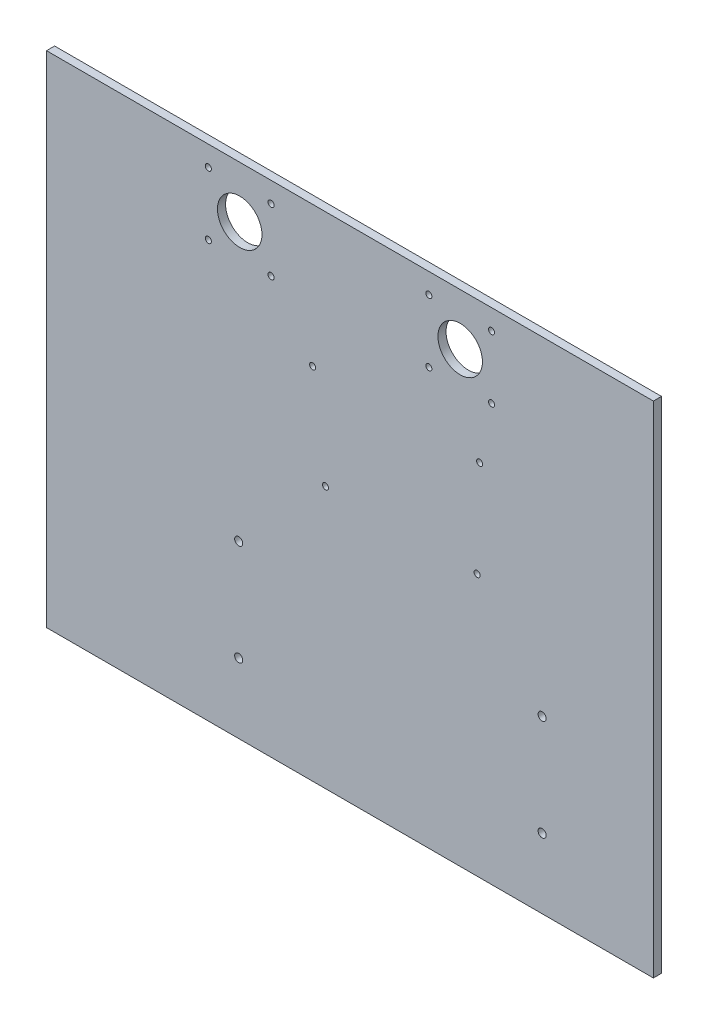
ISO-10303-21;
HEADER;
FILE_DESCRIPTION(('STEP AP214'),'2;1');
FILE_NAME('part.step','',(''),(''),'','','');
FILE_SCHEMA(('AUTOMOTIVE_DESIGN { 1 0 10303 214 1 1 1 1 }'));
ENDSEC;
DATA;
#1=APPLICATION_CONTEXT('core data for automotive mechanical design processes');
#2=APPLICATION_PROTOCOL_DEFINITION('international standard','automotive_design',2000,#1);
#3=PRODUCT_CONTEXT('',#1,'mechanical');
#4=PRODUCT('Part','Part','',(#3));
#5=PRODUCT_RELATED_PRODUCT_CATEGORY('part','',(#4));
#6=PRODUCT_DEFINITION_FORMATION('','',#4);
#7=PRODUCT_DEFINITION_CONTEXT('part definition',#1,'design');
#8=PRODUCT_DEFINITION('design','',#6,#7);
#9=PRODUCT_DEFINITION_SHAPE('','',#8);
#10=(LENGTH_UNIT() NAMED_UNIT(*) SI_UNIT(.MILLI.,.METRE.));
#11=(NAMED_UNIT(*) PLANE_ANGLE_UNIT() SI_UNIT($,.RADIAN.));
#12=(NAMED_UNIT(*) SI_UNIT($,.STERADIAN.) SOLID_ANGLE_UNIT());
#13=UNCERTAINTY_MEASURE_WITH_UNIT(LENGTH_MEASURE(1.E-05),#10,'distance_accuracy_value','');
#14=(GEOMETRIC_REPRESENTATION_CONTEXT(3) GLOBAL_UNCERTAINTY_ASSIGNED_CONTEXT((#13)) GLOBAL_UNIT_ASSIGNED_CONTEXT((#10,
#11,#12)) REPRESENTATION_CONTEXT('',''));
#15=CARTESIAN_POINT('',(0.,0.,0.));
#16=DIRECTION('',(0.,0.,1.));
#17=DIRECTION('',(1.,0.,0.));
#18=AXIS2_PLACEMENT_3D('',#15,#16,#17);
#19=CARTESIAN_POINT('',(0.,0.,4.));
#20=DIRECTION('',(0.,0.,1.));
#21=DIRECTION('',(1.,0.,0.));
#22=AXIS2_PLACEMENT_3D('',#19,#20,#21);
#23=PLANE('',#22);
#24=CARTESIAN_POINT('',(62.8513187967979,5.93512971337509,4.));
#25=DIRECTION('',(0.,0.,1.));
#26=DIRECTION('',(1.,0.,0.));
#27=AXIS2_PLACEMENT_3D('',#24,#25,#26);
#28=CIRCLE('',#27,1.5);
#29=CARTESIAN_POINT('',(64.3513187967979,5.93512971337509,4.));
#30=VERTEX_POINT('',#29);
#31=EDGE_CURVE('E205',#30,#30,#28,.T.);
#32=ORIENTED_EDGE('',*,*,#31,.F.);
#33=EDGE_LOOP('',(#32));
#34=FACE_BOUND('',#33,.T.);
#35=CARTESIAN_POINT('',(64.1213187967974,54.1951297133751,4.));
#36=DIRECTION('',(0.,0.,1.));
#37=DIRECTION('',(1.,0.,0.));
#38=AXIS2_PLACEMENT_3D('',#35,#36,#37);
#39=CIRCLE('',#38,1.5);
#40=CARTESIAN_POINT('',(65.6213187967974,54.1951297133751,4.));
#41=VERTEX_POINT('',#40);
#42=EDGE_CURVE('E193',#41,#41,#39,.T.);
#43=ORIENTED_EDGE('',*,*,#42,.F.);
#44=EDGE_LOOP('',(#43));
#45=FACE_BOUND('',#44,.T.);
#46=CARTESIAN_POINT('',(-55.0000000000043,-39.0000000000006,4.));
#47=DIRECTION('',(0.,0.,1.));
#48=DIRECTION('',(1.,0.,0.));
#49=AXIS2_PLACEMENT_3D('',#46,#47,#48);
#50=CIRCLE('',#49,2.);
#51=CARTESIAN_POINT('',(-53.0000000000042,-39.0000000000006,4.));
#52=VERTEX_POINT('',#51);
#53=EDGE_CURVE('E181',#52,#52,#50,.T.);
#54=ORIENTED_EDGE('',*,*,#53,.F.);
#55=EDGE_LOOP('',(#54));
#56=FACE_BOUND('',#55,.T.);
#57=CARTESIAN_POINT('',(94.9999999999957,-39.0000000000007,4.));
#58=DIRECTION('',(0.,0.,1.));
#59=DIRECTION('',(1.,0.,0.));
#60=AXIS2_PLACEMENT_3D('',#57,#58,#59);
#61=CIRCLE('',#60,2.);
#62=CARTESIAN_POINT('',(96.9999999999957,-39.0000000000007,4.));
#63=VERTEX_POINT('',#62);
#64=EDGE_CURVE('E169',#63,#63,#61,.T.);
#65=ORIENTED_EDGE('',*,*,#64,.F.);
#66=EDGE_LOOP('',(#65));
#67=FACE_BOUND('',#66,.T.);
#68=CARTESIAN_POINT('',(39.,113.5,4.));
#69=DIRECTION('',(0.,0.,1.));
#70=DIRECTION('',(-1.,0.,0.));
#71=AXIS2_PLACEMENT_3D('',#68,#69,#70);
#72=CIRCLE('',#71,1.5);
#73=CARTESIAN_POINT('',(37.5,113.5,4.));
#74=VERTEX_POINT('',#73);
#75=EDGE_CURVE('E157',#74,#74,#72,.T.);
#76=ORIENTED_EDGE('',*,*,#75,.F.);
#77=EDGE_LOOP('',(#76));
#78=FACE_BOUND('',#77,.T.);
#79=CARTESIAN_POINT('',(39.,82.5,4.));
#80=DIRECTION('',(0.,0.,1.));
#81=DIRECTION('',(-1.,0.,0.));
#82=AXIS2_PLACEMENT_3D('',#79,#80,#81);
#83=CIRCLE('',#82,1.5);
#84=CARTESIAN_POINT('',(37.5,82.5,4.));
#85=VERTEX_POINT('',#84);
#86=EDGE_CURVE('E145',#85,#85,#83,.T.);
#87=ORIENTED_EDGE('',*,*,#86,.F.);
#88=EDGE_LOOP('',(#87));
#89=FACE_BOUND('',#88,.T.);
#90=CARTESIAN_POINT('',(-54.5,98.,4.));
#91=DIRECTION('',(0.,0.,1.));
#92=DIRECTION('',(1.,0.,0.));
#93=AXIS2_PLACEMENT_3D('',#90,#91,#92);
#94=CIRCLE('',#93,11.);
#95=CARTESIAN_POINT('',(-43.5,98.,4.));
#96=VERTEX_POINT('',#95);
#97=EDGE_CURVE('E133',#96,#96,#94,.T.);
#98=ORIENTED_EDGE('',*,*,#97,.F.);
#99=EDGE_LOOP('',(#98));
#100=FACE_BOUND('',#99,.T.);
#101=CARTESIAN_POINT('',(-39.,82.5,4.));
#102=DIRECTION('',(0.,0.,1.));
#103=DIRECTION('',(1.,0.,0.));
#104=AXIS2_PLACEMENT_3D('',#101,#102,#103);
#105=CIRCLE('',#104,1.5);
#106=CARTESIAN_POINT('',(-37.5,82.5,4.));
#107=VERTEX_POINT('',#106);
#108=EDGE_CURVE('E121',#107,#107,#105,.T.);
#109=ORIENTED_EDGE('',*,*,#108,.F.);
#110=EDGE_LOOP('',(#109));
#111=FACE_BOUND('',#110,.T.);
#112=CARTESIAN_POINT('',(-70.,113.5,4.));
#113=DIRECTION('',(0.,0.,1.));
#114=DIRECTION('',(1.,0.,0.));
#115=AXIS2_PLACEMENT_3D('',#112,#113,#114);
#116=CIRCLE('',#115,1.5);
#117=CARTESIAN_POINT('',(-68.5,113.5,4.));
#118=VERTEX_POINT('',#117);
#119=EDGE_CURVE('E100',#118,#118,#116,.T.);
#120=ORIENTED_EDGE('',*,*,#119,.F.);
#121=EDGE_LOOP('',(#120));
#122=FACE_BOUND('',#121,.T.);
#123=DIRECTION('',(0.,-1.,0.));
#124=VECTOR('',#123,1.);
#125=CARTESIAN_POINT('',(-150.,-123.5,4.));
#126=LINE('',#125,#124);
#127=CARTESIAN_POINT('',(-150.,123.5,4.));
#128=VERTEX_POINT('',#127);
#129=CARTESIAN_POINT('',(-150.,-123.5,4.));
#130=VERTEX_POINT('',#129);
#131=EDGE_CURVE('E85',#128,#130,#126,.T.);
#132=ORIENTED_EDGE('',*,*,#131,.T.);
#133=DIRECTION('',(1.,0.,0.));
#134=VECTOR('',#133,1.);
#135=CARTESIAN_POINT('',(150.,-123.5,4.));
#136=LINE('',#135,#134);
#137=CARTESIAN_POINT('',(150.,-123.5,4.));
#138=VERTEX_POINT('',#137);
#139=EDGE_CURVE('E80',#130,#138,#136,.T.);
#140=ORIENTED_EDGE('',*,*,#139,.T.);
#141=DIRECTION('',(0.,1.,0.));
#142=VECTOR('',#141,1.);
#143=CARTESIAN_POINT('',(150.,-123.5,4.));
#144=LINE('',#143,#142);
#145=CARTESIAN_POINT('',(150.,123.5,4.));
#146=VERTEX_POINT('',#145);
#147=EDGE_CURVE('E83',#138,#146,#144,.T.);
#148=ORIENTED_EDGE('',*,*,#147,.T.);
#149=DIRECTION('',(-1.,0.,0.));
#150=VECTOR('',#149,1.);
#151=CARTESIAN_POINT('',(150.,123.5,4.));
#152=LINE('',#151,#150);
#153=EDGE_CURVE('E50',#146,#128,#152,.T.);
#154=ORIENTED_EDGE('',*,*,#153,.T.);
#155=EDGE_LOOP('',(#132,#140,#148,#154));
#156=FACE_BOUND('',#155,.T.);
#157=CARTESIAN_POINT('',(-39.,113.5,4.));
#158=DIRECTION('',(0.,0.,1.));
#159=DIRECTION('',(1.,0.,0.));
#160=AXIS2_PLACEMENT_3D('',#157,#158,#159);
#161=CIRCLE('',#160,1.5);
#162=CARTESIAN_POINT('',(-37.5,113.5,4.));
#163=VERTEX_POINT('',#162);
#164=EDGE_CURVE('E115',#163,#163,#161,.T.);
#165=ORIENTED_EDGE('',*,*,#164,.F.);
#166=EDGE_LOOP('',(#165));
#167=FACE_BOUND('',#166,.T.);
#168=CARTESIAN_POINT('',(-70.,82.5,4.));
#169=DIRECTION('',(0.,0.,1.));
#170=DIRECTION('',(1.,0.,0.));
#171=AXIS2_PLACEMENT_3D('',#168,#169,#170);
#172=CIRCLE('',#171,1.5);
#173=CARTESIAN_POINT('',(-68.5,82.5,4.));
#174=VERTEX_POINT('',#173);
#175=EDGE_CURVE('E127',#174,#174,#172,.T.);
#176=ORIENTED_EDGE('',*,*,#175,.F.);
#177=EDGE_LOOP('',(#176));
#178=FACE_BOUND('',#177,.T.);
#179=CARTESIAN_POINT('',(70.,82.5,4.));
#180=DIRECTION('',(0.,0.,1.));
#181=DIRECTION('',(-1.,0.,0.));
#182=AXIS2_PLACEMENT_3D('',#179,#180,#181);
#183=CIRCLE('',#182,1.5);
#184=CARTESIAN_POINT('',(68.5,82.5,4.));
#185=VERTEX_POINT('',#184);
#186=EDGE_CURVE('E139',#185,#185,#183,.T.);
#187=ORIENTED_EDGE('',*,*,#186,.F.);
#188=EDGE_LOOP('',(#187));
#189=FACE_BOUND('',#188,.T.);
#190=CARTESIAN_POINT('',(54.5,98.,4.));
#191=DIRECTION('',(0.,0.,1.));
#192=DIRECTION('',(-1.,0.,0.));
#193=AXIS2_PLACEMENT_3D('',#190,#191,#192);
#194=CIRCLE('',#193,11.);
#195=CARTESIAN_POINT('',(43.5,98.,4.));
#196=VERTEX_POINT('',#195);
#197=EDGE_CURVE('E151',#196,#196,#194,.T.);
#198=ORIENTED_EDGE('',*,*,#197,.F.);
#199=EDGE_LOOP('',(#198));
#200=FACE_BOUND('',#199,.T.);
#201=CARTESIAN_POINT('',(70.,113.5,4.));
#202=DIRECTION('',(0.,0.,1.));
#203=DIRECTION('',(-1.,0.,0.));
#204=AXIS2_PLACEMENT_3D('',#201,#202,#203);
#205=CIRCLE('',#204,1.5);
#206=CARTESIAN_POINT('',(68.5,113.5,4.));
#207=VERTEX_POINT('',#206);
#208=EDGE_CURVE('E163',#207,#207,#205,.T.);
#209=ORIENTED_EDGE('',*,*,#208,.F.);
#210=EDGE_LOOP('',(#209));
#211=FACE_BOUND('',#210,.T.);
#212=CARTESIAN_POINT('',(94.9999999999957,-89.0000000000011,4.));
#213=DIRECTION('',(0.,0.,1.));
#214=DIRECTION('',(1.,0.,0.));
#215=AXIS2_PLACEMENT_3D('',#212,#213,#214);
#216=CIRCLE('',#215,2.);
#217=CARTESIAN_POINT('',(96.9999999999957,-89.0000000000011,4.));
#218=VERTEX_POINT('',#217);
#219=EDGE_CURVE('E175',#218,#218,#216,.T.);
#220=ORIENTED_EDGE('',*,*,#219,.F.);
#221=EDGE_LOOP('',(#220));
#222=FACE_BOUND('',#221,.T.);
#223=CARTESIAN_POINT('',(-55.0000000000042,-89.0000000000011,4.));
#224=DIRECTION('',(0.,0.,1.));
#225=DIRECTION('',(1.,0.,0.));
#226=AXIS2_PLACEMENT_3D('',#223,#224,#225);
#227=CIRCLE('',#226,2.);
#228=CARTESIAN_POINT('',(-53.0000000000042,-89.0000000000011,4.));
#229=VERTEX_POINT('',#228);
#230=EDGE_CURVE('E187',#229,#229,#227,.T.);
#231=ORIENTED_EDGE('',*,*,#230,.F.);
#232=EDGE_LOOP('',(#231));
#233=FACE_BOUND('',#232,.T.);
#234=CARTESIAN_POINT('',(-12.0786812032021,5.93512971337443,4.));
#235=DIRECTION('',(0.,0.,1.));
#236=DIRECTION('',(1.,0.,0.));
#237=AXIS2_PLACEMENT_3D('',#234,#235,#236);
#238=CIRCLE('',#237,1.5);
#239=CARTESIAN_POINT('',(-10.5786812032021,5.93512971337443,4.));
#240=VERTEX_POINT('',#239);
#241=EDGE_CURVE('E199',#240,#240,#238,.T.);
#242=ORIENTED_EDGE('',*,*,#241,.F.);
#243=EDGE_LOOP('',(#242));
#244=FACE_BOUND('',#243,.T.);
#245=CARTESIAN_POINT('',(-18.4286812032026,54.1951297133744,4.));
#246=DIRECTION('',(0.,0.,1.));
#247=DIRECTION('',(1.,0.,0.));
#248=AXIS2_PLACEMENT_3D('',#245,#246,#247);
#249=CIRCLE('',#248,1.5);
#250=CARTESIAN_POINT('',(-16.9286812032026,54.1951297133744,4.));
#251=VERTEX_POINT('',#250);
#252=EDGE_CURVE('E211',#251,#251,#249,.T.);
#253=ORIENTED_EDGE('',*,*,#252,.F.);
#254=EDGE_LOOP('',(#253));
#255=FACE_BOUND('',#254,.T.);
#256=ADVANCED_FACE('F33',(#34,#45,#56,#67,#78,#89,#100,#111,#122,#156,#167,#178,#189,#200,#211,
#222,#233,#244,#255),#23,.T.);
#257=CARTESIAN_POINT('',(0.,0.,0.));
#258=DIRECTION('',(0.,0.,1.));
#259=DIRECTION('',(1.,0.,0.));
#260=AXIS2_PLACEMENT_3D('',#257,#258,#259);
#261=PLANE('',#260);
#262=DIRECTION('',(0.,-1.,0.));
#263=VECTOR('',#262,1.);
#264=CARTESIAN_POINT('',(-150.,-123.5,0.));
#265=LINE('',#264,#263);
#266=CARTESIAN_POINT('',(-150.,123.5,0.));
#267=VERTEX_POINT('',#266);
#268=CARTESIAN_POINT('',(-150.,-123.5,0.));
#269=VERTEX_POINT('',#268);
#270=EDGE_CURVE('E97',#267,#269,#265,.T.);
#271=ORIENTED_EDGE('',*,*,#270,.F.);
#272=DIRECTION('',(-1.,0.,0.));
#273=VECTOR('',#272,1.);
#274=CARTESIAN_POINT('',(150.,123.5,0.));
#275=LINE('',#274,#273);
#276=CARTESIAN_POINT('',(150.,123.5,0.));
#277=VERTEX_POINT('',#276);
#278=EDGE_CURVE('E73',#277,#267,#275,.T.);
#279=ORIENTED_EDGE('',*,*,#278,.F.);
#280=DIRECTION('',(0.,1.,0.));
#281=VECTOR('',#280,1.);
#282=CARTESIAN_POINT('',(150.,-123.5,0.));
#283=LINE('',#282,#281);
#284=CARTESIAN_POINT('',(150.,-123.5,0.));
#285=VERTEX_POINT('',#284);
#286=EDGE_CURVE('E67',#285,#277,#283,.T.);
#287=ORIENTED_EDGE('',*,*,#286,.F.);
#288=DIRECTION('',(1.,0.,0.));
#289=VECTOR('',#288,1.);
#290=CARTESIAN_POINT('',(150.,-123.5,0.));
#291=LINE('',#290,#289);
#292=EDGE_CURVE('E89',#269,#285,#291,.T.);
#293=ORIENTED_EDGE('',*,*,#292,.F.);
#294=EDGE_LOOP('',(#271,#279,#287,#293));
#295=FACE_BOUND('',#294,.T.);
#296=CARTESIAN_POINT('',(-70.,113.5,0.));
#297=DIRECTION('',(0.,0.,1.));
#298=DIRECTION('',(1.,0.,0.));
#299=AXIS2_PLACEMENT_3D('',#296,#297,#298);
#300=CIRCLE('',#299,1.5);
#301=CARTESIAN_POINT('',(-68.5,113.5,0.));
#302=VERTEX_POINT('',#301);
#303=EDGE_CURVE('E112',#302,#302,#300,.T.);
#304=ORIENTED_EDGE('',*,*,#303,.T.);
#305=EDGE_LOOP('',(#304));
#306=FACE_BOUND('',#305,.T.);
#307=CARTESIAN_POINT('',(-39.,113.5,0.));
#308=DIRECTION('',(0.,0.,1.));
#309=DIRECTION('',(1.,0.,0.));
#310=AXIS2_PLACEMENT_3D('',#307,#308,#309);
#311=CIRCLE('',#310,1.5);
#312=CARTESIAN_POINT('',(-37.5,113.5,0.));
#313=VERTEX_POINT('',#312);
#314=EDGE_CURVE('E118',#313,#313,#311,.T.);
#315=ORIENTED_EDGE('',*,*,#314,.T.);
#316=EDGE_LOOP('',(#315));
#317=FACE_BOUND('',#316,.T.);
#318=CARTESIAN_POINT('',(-39.,82.5,0.));
#319=DIRECTION('',(0.,0.,1.));
#320=DIRECTION('',(1.,0.,0.));
#321=AXIS2_PLACEMENT_3D('',#318,#319,#320);
#322=CIRCLE('',#321,1.5);
#323=CARTESIAN_POINT('',(-37.5,82.5,0.));
#324=VERTEX_POINT('',#323);
#325=EDGE_CURVE('E124',#324,#324,#322,.T.);
#326=ORIENTED_EDGE('',*,*,#325,.T.);
#327=EDGE_LOOP('',(#326));
#328=FACE_BOUND('',#327,.T.);
#329=CARTESIAN_POINT('',(-70.,82.5,0.));
#330=DIRECTION('',(0.,0.,1.));
#331=DIRECTION('',(1.,0.,0.));
#332=AXIS2_PLACEMENT_3D('',#329,#330,#331);
#333=CIRCLE('',#332,1.5);
#334=CARTESIAN_POINT('',(-68.5,82.5,0.));
#335=VERTEX_POINT('',#334);
#336=EDGE_CURVE('E130',#335,#335,#333,.T.);
#337=ORIENTED_EDGE('',*,*,#336,.T.);
#338=EDGE_LOOP('',(#337));
#339=FACE_BOUND('',#338,.T.);
#340=CARTESIAN_POINT('',(-54.5,98.,0.));
#341=DIRECTION('',(0.,0.,1.));
#342=DIRECTION('',(1.,0.,0.));
#343=AXIS2_PLACEMENT_3D('',#340,#341,#342);
#344=CIRCLE('',#343,11.);
#345=CARTESIAN_POINT('',(-43.5,98.,0.));
#346=VERTEX_POINT('',#345);
#347=EDGE_CURVE('E136',#346,#346,#344,.T.);
#348=ORIENTED_EDGE('',*,*,#347,.T.);
#349=EDGE_LOOP('',(#348));
#350=FACE_BOUND('',#349,.T.);
#351=CARTESIAN_POINT('',(70.,82.5,0.));
#352=DIRECTION('',(0.,0.,1.));
#353=DIRECTION('',(-1.,0.,0.));
#354=AXIS2_PLACEMENT_3D('',#351,#352,#353);
#355=CIRCLE('',#354,1.5);
#356=CARTESIAN_POINT('',(68.5,82.5,0.));
#357=VERTEX_POINT('',#356);
#358=EDGE_CURVE('E142',#357,#357,#355,.T.);
#359=ORIENTED_EDGE('',*,*,#358,.T.);
#360=EDGE_LOOP('',(#359));
#361=FACE_BOUND('',#360,.T.);
#362=CARTESIAN_POINT('',(39.,82.5,0.));
#363=DIRECTION('',(0.,0.,1.));
#364=DIRECTION('',(-1.,0.,0.));
#365=AXIS2_PLACEMENT_3D('',#362,#363,#364);
#366=CIRCLE('',#365,1.5);
#367=CARTESIAN_POINT('',(37.5,82.5,0.));
#368=VERTEX_POINT('',#367);
#369=EDGE_CURVE('E148',#368,#368,#366,.T.);
#370=ORIENTED_EDGE('',*,*,#369,.T.);
#371=EDGE_LOOP('',(#370));
#372=FACE_BOUND('',#371,.T.);
#373=CARTESIAN_POINT('',(54.5,98.,0.));
#374=DIRECTION('',(0.,0.,1.));
#375=DIRECTION('',(-1.,0.,0.));
#376=AXIS2_PLACEMENT_3D('',#373,#374,#375);
#377=CIRCLE('',#376,11.);
#378=CARTESIAN_POINT('',(43.5,98.,0.));
#379=VERTEX_POINT('',#378);
#380=EDGE_CURVE('E154',#379,#379,#377,.T.);
#381=ORIENTED_EDGE('',*,*,#380,.T.);
#382=EDGE_LOOP('',(#381));
#383=FACE_BOUND('',#382,.T.);
#384=CARTESIAN_POINT('',(39.,113.5,0.));
#385=DIRECTION('',(0.,0.,1.));
#386=DIRECTION('',(-1.,0.,0.));
#387=AXIS2_PLACEMENT_3D('',#384,#385,#386);
#388=CIRCLE('',#387,1.5);
#389=CARTESIAN_POINT('',(37.5,113.5,0.));
#390=VERTEX_POINT('',#389);
#391=EDGE_CURVE('E160',#390,#390,#388,.T.);
#392=ORIENTED_EDGE('',*,*,#391,.T.);
#393=EDGE_LOOP('',(#392));
#394=FACE_BOUND('',#393,.T.);
#395=CARTESIAN_POINT('',(70.,113.5,0.));
#396=DIRECTION('',(0.,0.,1.));
#397=DIRECTION('',(-1.,0.,0.));
#398=AXIS2_PLACEMENT_3D('',#395,#396,#397);
#399=CIRCLE('',#398,1.5);
#400=CARTESIAN_POINT('',(68.5,113.5,0.));
#401=VERTEX_POINT('',#400);
#402=EDGE_CURVE('E166',#401,#401,#399,.T.);
#403=ORIENTED_EDGE('',*,*,#402,.T.);
#404=EDGE_LOOP('',(#403));
#405=FACE_BOUND('',#404,.T.);
#406=CARTESIAN_POINT('',(94.9999999999957,-39.0000000000007,0.));
#407=DIRECTION('',(0.,0.,1.));
#408=DIRECTION('',(1.,0.,0.));
#409=AXIS2_PLACEMENT_3D('',#406,#407,#408);
#410=CIRCLE('',#409,2.);
#411=CARTESIAN_POINT('',(96.9999999999957,-39.0000000000007,0.));
#412=VERTEX_POINT('',#411);
#413=EDGE_CURVE('E172',#412,#412,#410,.T.);
#414=ORIENTED_EDGE('',*,*,#413,.T.);
#415=EDGE_LOOP('',(#414));
#416=FACE_BOUND('',#415,.T.);
#417=CARTESIAN_POINT('',(94.9999999999957,-89.0000000000011,0.));
#418=DIRECTION('',(0.,0.,1.));
#419=DIRECTION('',(1.,0.,0.));
#420=AXIS2_PLACEMENT_3D('',#417,#418,#419);
#421=CIRCLE('',#420,2.);
#422=CARTESIAN_POINT('',(96.9999999999957,-89.0000000000011,0.));
#423=VERTEX_POINT('',#422);
#424=EDGE_CURVE('E178',#423,#423,#421,.T.);
#425=ORIENTED_EDGE('',*,*,#424,.T.);
#426=EDGE_LOOP('',(#425));
#427=FACE_BOUND('',#426,.T.);
#428=CARTESIAN_POINT('',(-55.0000000000043,-39.0000000000006,0.));
#429=DIRECTION('',(0.,0.,1.));
#430=DIRECTION('',(1.,0.,0.));
#431=AXIS2_PLACEMENT_3D('',#428,#429,#430);
#432=CIRCLE('',#431,2.);
#433=CARTESIAN_POINT('',(-53.0000000000042,-39.0000000000006,0.));
#434=VERTEX_POINT('',#433);
#435=EDGE_CURVE('E184',#434,#434,#432,.T.);
#436=ORIENTED_EDGE('',*,*,#435,.T.);
#437=EDGE_LOOP('',(#436));
#438=FACE_BOUND('',#437,.T.);
#439=CARTESIAN_POINT('',(-55.0000000000042,-89.0000000000011,0.));
#440=DIRECTION('',(0.,0.,1.));
#441=DIRECTION('',(1.,0.,0.));
#442=AXIS2_PLACEMENT_3D('',#439,#440,#441);
#443=CIRCLE('',#442,2.);
#444=CARTESIAN_POINT('',(-53.0000000000042,-89.0000000000011,0.));
#445=VERTEX_POINT('',#444);
#446=EDGE_CURVE('E190',#445,#445,#443,.T.);
#447=ORIENTED_EDGE('',*,*,#446,.T.);
#448=EDGE_LOOP('',(#447));
#449=FACE_BOUND('',#448,.T.);
#450=CARTESIAN_POINT('',(64.1213187967974,54.1951297133751,0.));
#451=DIRECTION('',(0.,0.,1.));
#452=DIRECTION('',(1.,0.,0.));
#453=AXIS2_PLACEMENT_3D('',#450,#451,#452);
#454=CIRCLE('',#453,1.5);
#455=CARTESIAN_POINT('',(65.6213187967974,54.1951297133751,0.));
#456=VERTEX_POINT('',#455);
#457=EDGE_CURVE('E196',#456,#456,#454,.T.);
#458=ORIENTED_EDGE('',*,*,#457,.T.);
#459=EDGE_LOOP('',(#458));
#460=FACE_BOUND('',#459,.T.);
#461=CARTESIAN_POINT('',(-12.0786812032021,5.93512971337443,0.));
#462=DIRECTION('',(0.,0.,1.));
#463=DIRECTION('',(1.,0.,0.));
#464=AXIS2_PLACEMENT_3D('',#461,#462,#463);
#465=CIRCLE('',#464,1.5);
#466=CARTESIAN_POINT('',(-10.5786812032021,5.93512971337443,0.));
#467=VERTEX_POINT('',#466);
#468=EDGE_CURVE('E202',#467,#467,#465,.T.);
#469=ORIENTED_EDGE('',*,*,#468,.T.);
#470=EDGE_LOOP('',(#469));
#471=FACE_BOUND('',#470,.T.);
#472=CARTESIAN_POINT('',(62.8513187967979,5.93512971337509,0.));
#473=DIRECTION('',(0.,0.,1.));
#474=DIRECTION('',(1.,0.,0.));
#475=AXIS2_PLACEMENT_3D('',#472,#473,#474);
#476=CIRCLE('',#475,1.5);
#477=CARTESIAN_POINT('',(64.3513187967979,5.93512971337509,0.));
#478=VERTEX_POINT('',#477);
#479=EDGE_CURVE('E208',#478,#478,#476,.T.);
#480=ORIENTED_EDGE('',*,*,#479,.T.);
#481=EDGE_LOOP('',(#480));
#482=FACE_BOUND('',#481,.T.);
#483=CARTESIAN_POINT('',(-18.4286812032026,54.1951297133744,0.));
#484=DIRECTION('',(0.,0.,1.));
#485=DIRECTION('',(1.,0.,0.));
#486=AXIS2_PLACEMENT_3D('',#483,#484,#485);
#487=CIRCLE('',#486,1.5);
#488=CARTESIAN_POINT('',(-16.9286812032026,54.1951297133744,0.));
#489=VERTEX_POINT('',#488);
#490=EDGE_CURVE('E214',#489,#489,#487,.T.);
#491=ORIENTED_EDGE('',*,*,#490,.T.);
#492=EDGE_LOOP('',(#491));
#493=FACE_BOUND('',#492,.T.);
#494=ADVANCED_FACE('F108',(#295,#306,#317,#328,#339,#350,#361,#372,#383,#394,#405,#416,#427,
#438,#449,#460,#471,#482,#493),#261,.F.);
#495=CARTESIAN_POINT('',(-150.,-123.5,4.));
#496=DIRECTION('',(1.,0.,0.));
#497=DIRECTION('',(0.,1.,0.));
#498=AXIS2_PLACEMENT_3D('',#495,#496,#497);
#499=PLANE('',#498);
#500=ORIENTED_EDGE('',*,*,#270,.T.);
#501=DIRECTION('',(0.,0.,-1.));
#502=VECTOR('',#501,1.);
#503=CARTESIAN_POINT('',(-150.,-123.5,4.));
#504=LINE('',#503,#502);
#505=EDGE_CURVE('E11',#130,#269,#504,.T.);
#506=ORIENTED_EDGE('',*,*,#505,.F.);
#507=ORIENTED_EDGE('',*,*,#131,.F.);
#508=DIRECTION('',(0.,0.,-1.));
#509=VECTOR('',#508,1.);
#510=CARTESIAN_POINT('',(-150.,123.5,4.));
#511=LINE('',#510,#509);
#512=EDGE_CURVE('E93',#128,#267,#511,.T.);
#513=ORIENTED_EDGE('',*,*,#512,.T.);
#514=EDGE_LOOP('',(#500,#506,#507,#513));
#515=FACE_BOUND('',#514,.T.);
#516=ADVANCED_FACE('F35',(#515),#499,.F.);
#517=CARTESIAN_POINT('',(150.,-123.5,4.));
#518=DIRECTION('',(0.,1.,0.));
#519=DIRECTION('',(-1.,0.,0.));
#520=AXIS2_PLACEMENT_3D('',#517,#518,#519);
#521=PLANE('',#520);
#522=ORIENTED_EDGE('',*,*,#292,.T.);
#523=DIRECTION('',(0.,0.,-1.));
#524=VECTOR('',#523,1.);
#525=CARTESIAN_POINT('',(150.,-123.5,4.));
#526=LINE('',#525,#524);
#527=EDGE_CURVE('E42',#138,#285,#526,.T.);
#528=ORIENTED_EDGE('',*,*,#527,.F.);
#529=ORIENTED_EDGE('',*,*,#139,.F.);
#530=ORIENTED_EDGE('',*,*,#505,.T.);
#531=EDGE_LOOP('',(#522,#528,#529,#530));
#532=FACE_BOUND('',#531,.T.);
#533=ADVANCED_FACE('F88',(#532),#521,.F.);
#534=CARTESIAN_POINT('',(150.,-123.5,4.));
#535=DIRECTION('',(-1.,0.,0.));
#536=DIRECTION('',(0.,0.,1.));
#537=AXIS2_PLACEMENT_3D('',#534,#535,#536);
#538=PLANE('',#537);
#539=ORIENTED_EDGE('',*,*,#286,.T.);
#540=DIRECTION('',(0.,0.,-1.));
#541=VECTOR('',#540,1.);
#542=CARTESIAN_POINT('',(150.,123.5,4.));
#543=LINE('',#542,#541);
#544=EDGE_CURVE('E90',#146,#277,#543,.T.);
#545=ORIENTED_EDGE('',*,*,#544,.F.);
#546=ORIENTED_EDGE('',*,*,#147,.F.);
#547=ORIENTED_EDGE('',*,*,#527,.T.);
#548=EDGE_LOOP('',(#539,#545,#546,#547));
#549=FACE_BOUND('',#548,.T.);
#550=ADVANCED_FACE('F91',(#549),#538,.F.);
#551=CARTESIAN_POINT('',(150.,123.5,4.));
#552=DIRECTION('',(0.,-1.,0.));
#553=DIRECTION('',(1.,0.,0.));
#554=AXIS2_PLACEMENT_3D('',#551,#552,#553);
#555=PLANE('',#554);
#556=ORIENTED_EDGE('',*,*,#278,.T.);
#557=ORIENTED_EDGE('',*,*,#512,.F.);
#558=ORIENTED_EDGE('',*,*,#153,.F.);
#559=ORIENTED_EDGE('',*,*,#544,.T.);
#560=EDGE_LOOP('',(#556,#557,#558,#559));
#561=FACE_BOUND('',#560,.T.);
#562=ADVANCED_FACE('F105',(#561),#555,.F.);
#563=CARTESIAN_POINT('',(-70.,113.5,4.));
#564=DIRECTION('',(0.,0.,-1.));
#565=DIRECTION('',(-1.,0.,0.));
#566=AXIS2_PLACEMENT_3D('',#563,#564,#565);
#567=CYLINDRICAL_SURFACE('',#566,1.5);
#568=ORIENTED_EDGE('',*,*,#119,.T.);
#569=EDGE_LOOP('',(#568));
#570=FACE_BOUND('',#569,.T.);
#571=ORIENTED_EDGE('',*,*,#303,.F.);
#572=EDGE_LOOP('',(#571));
#573=FACE_BOUND('',#572,.T.);
#574=ADVANCED_FACE('F233',(#570,#573),#567,.F.);
#575=CARTESIAN_POINT('',(-39.,113.5,4.));
#576=DIRECTION('',(0.,0.,-1.));
#577=DIRECTION('',(-1.,0.,0.));
#578=AXIS2_PLACEMENT_3D('',#575,#576,#577);
#579=CYLINDRICAL_SURFACE('',#578,1.5);
#580=ORIENTED_EDGE('',*,*,#164,.T.);
#581=EDGE_LOOP('',(#580));
#582=FACE_BOUND('',#581,.T.);
#583=ORIENTED_EDGE('',*,*,#314,.F.);
#584=EDGE_LOOP('',(#583));
#585=FACE_BOUND('',#584,.T.);
#586=ADVANCED_FACE('F279',(#582,#585),#579,.F.);
#587=CARTESIAN_POINT('',(-39.,82.5,4.));
#588=DIRECTION('',(0.,0.,-1.));
#589=DIRECTION('',(-1.,0.,0.));
#590=AXIS2_PLACEMENT_3D('',#587,#588,#589);
#591=CYLINDRICAL_SURFACE('',#590,1.5);
#592=ORIENTED_EDGE('',*,*,#108,.T.);
#593=EDGE_LOOP('',(#592));
#594=FACE_BOUND('',#593,.T.);
#595=ORIENTED_EDGE('',*,*,#325,.F.);
#596=EDGE_LOOP('',(#595));
#597=FACE_BOUND('',#596,.T.);
#598=ADVANCED_FACE('F287',(#594,#597),#591,.F.);
#599=CARTESIAN_POINT('',(-70.,82.5,4.));
#600=DIRECTION('',(0.,0.,-1.));
#601=DIRECTION('',(-1.,0.,0.));
#602=AXIS2_PLACEMENT_3D('',#599,#600,#601);
#603=CYLINDRICAL_SURFACE('',#602,1.5);
#604=ORIENTED_EDGE('',*,*,#175,.T.);
#605=EDGE_LOOP('',(#604));
#606=FACE_BOUND('',#605,.T.);
#607=ORIENTED_EDGE('',*,*,#336,.F.);
#608=EDGE_LOOP('',(#607));
#609=FACE_BOUND('',#608,.T.);
#610=ADVANCED_FACE('F295',(#606,#609),#603,.F.);
#611=CARTESIAN_POINT('',(-54.5,98.,4.));
#612=DIRECTION('',(0.,0.,-1.));
#613=DIRECTION('',(-1.,0.,0.));
#614=AXIS2_PLACEMENT_3D('',#611,#612,#613);
#615=CYLINDRICAL_SURFACE('',#614,11.);
#616=ORIENTED_EDGE('',*,*,#97,.T.);
#617=EDGE_LOOP('',(#616));
#618=FACE_BOUND('',#617,.T.);
#619=ORIENTED_EDGE('',*,*,#347,.F.);
#620=EDGE_LOOP('',(#619));
#621=FACE_BOUND('',#620,.T.);
#622=ADVANCED_FACE('F304',(#618,#621),#615,.F.);
#623=CARTESIAN_POINT('',(70.,82.5,4.));
#624=DIRECTION('',(0.,0.,-1.));
#625=DIRECTION('',(-1.,0.,0.));
#626=AXIS2_PLACEMENT_3D('',#623,#624,#625);
#627=CYLINDRICAL_SURFACE('',#626,1.5);
#628=ORIENTED_EDGE('',*,*,#186,.T.);
#629=EDGE_LOOP('',(#628));
#630=FACE_BOUND('',#629,.T.);
#631=ORIENTED_EDGE('',*,*,#358,.F.);
#632=EDGE_LOOP('',(#631));
#633=FACE_BOUND('',#632,.T.);
#634=ADVANCED_FACE('F313',(#630,#633),#627,.F.);
#635=CARTESIAN_POINT('',(39.,82.5,4.));
#636=DIRECTION('',(0.,0.,-1.));
#637=DIRECTION('',(-1.,0.,0.));
#638=AXIS2_PLACEMENT_3D('',#635,#636,#637);
#639=CYLINDRICAL_SURFACE('',#638,1.5);
#640=ORIENTED_EDGE('',*,*,#86,.T.);
#641=EDGE_LOOP('',(#640));
#642=FACE_BOUND('',#641,.T.);
#643=ORIENTED_EDGE('',*,*,#369,.F.);
#644=EDGE_LOOP('',(#643));
#645=FACE_BOUND('',#644,.T.);
#646=ADVANCED_FACE('F322',(#642,#645),#639,.F.);
#647=CARTESIAN_POINT('',(54.5,98.,4.));
#648=DIRECTION('',(0.,0.,-1.));
#649=DIRECTION('',(-1.,0.,0.));
#650=AXIS2_PLACEMENT_3D('',#647,#648,#649);
#651=CYLINDRICAL_SURFACE('',#650,11.);
#652=ORIENTED_EDGE('',*,*,#197,.T.);
#653=EDGE_LOOP('',(#652));
#654=FACE_BOUND('',#653,.T.);
#655=ORIENTED_EDGE('',*,*,#380,.F.);
#656=EDGE_LOOP('',(#655));
#657=FACE_BOUND('',#656,.T.);
#658=ADVANCED_FACE('F331',(#654,#657),#651,.F.);
#659=CARTESIAN_POINT('',(39.,113.5,4.));
#660=DIRECTION('',(0.,0.,-1.));
#661=DIRECTION('',(-1.,0.,0.));
#662=AXIS2_PLACEMENT_3D('',#659,#660,#661);
#663=CYLINDRICAL_SURFACE('',#662,1.5);
#664=ORIENTED_EDGE('',*,*,#75,.T.);
#665=EDGE_LOOP('',(#664));
#666=FACE_BOUND('',#665,.T.);
#667=ORIENTED_EDGE('',*,*,#391,.F.);
#668=EDGE_LOOP('',(#667));
#669=FACE_BOUND('',#668,.T.);
#670=ADVANCED_FACE('F340',(#666,#669),#663,.F.);
#671=CARTESIAN_POINT('',(70.,113.5,4.));
#672=DIRECTION('',(0.,0.,-1.));
#673=DIRECTION('',(-1.,0.,0.));
#674=AXIS2_PLACEMENT_3D('',#671,#672,#673);
#675=CYLINDRICAL_SURFACE('',#674,1.5);
#676=ORIENTED_EDGE('',*,*,#208,.T.);
#677=EDGE_LOOP('',(#676));
#678=FACE_BOUND('',#677,.T.);
#679=ORIENTED_EDGE('',*,*,#402,.F.);
#680=EDGE_LOOP('',(#679));
#681=FACE_BOUND('',#680,.T.);
#682=ADVANCED_FACE('F349',(#678,#681),#675,.F.);
#683=CARTESIAN_POINT('',(94.9999999999957,-39.0000000000007,4.));
#684=DIRECTION('',(0.,0.,-1.));
#685=DIRECTION('',(-1.,0.,0.));
#686=AXIS2_PLACEMENT_3D('',#683,#684,#685);
#687=CYLINDRICAL_SURFACE('',#686,2.);
#688=ORIENTED_EDGE('',*,*,#64,.T.);
#689=EDGE_LOOP('',(#688));
#690=FACE_BOUND('',#689,.T.);
#691=ORIENTED_EDGE('',*,*,#413,.F.);
#692=EDGE_LOOP('',(#691));
#693=FACE_BOUND('',#692,.T.);
#694=ADVANCED_FACE('F358',(#690,#693),#687,.F.);
#695=CARTESIAN_POINT('',(94.9999999999957,-89.0000000000011,4.));
#696=DIRECTION('',(0.,0.,-1.));
#697=DIRECTION('',(-1.,0.,0.));
#698=AXIS2_PLACEMENT_3D('',#695,#696,#697);
#699=CYLINDRICAL_SURFACE('',#698,2.);
#700=ORIENTED_EDGE('',*,*,#219,.T.);
#701=EDGE_LOOP('',(#700));
#702=FACE_BOUND('',#701,.T.);
#703=ORIENTED_EDGE('',*,*,#424,.F.);
#704=EDGE_LOOP('',(#703));
#705=FACE_BOUND('',#704,.T.);
#706=ADVANCED_FACE('F367',(#702,#705),#699,.F.);
#707=CARTESIAN_POINT('',(-55.0000000000043,-39.0000000000006,4.));
#708=DIRECTION('',(0.,0.,-1.));
#709=DIRECTION('',(-1.,0.,0.));
#710=AXIS2_PLACEMENT_3D('',#707,#708,#709);
#711=CYLINDRICAL_SURFACE('',#710,2.);
#712=ORIENTED_EDGE('',*,*,#53,.T.);
#713=EDGE_LOOP('',(#712));
#714=FACE_BOUND('',#713,.T.);
#715=ORIENTED_EDGE('',*,*,#435,.F.);
#716=EDGE_LOOP('',(#715));
#717=FACE_BOUND('',#716,.T.);
#718=ADVANCED_FACE('F376',(#714,#717),#711,.F.);
#719=CARTESIAN_POINT('',(-55.0000000000042,-89.0000000000011,4.));
#720=DIRECTION('',(0.,0.,-1.));
#721=DIRECTION('',(-1.,0.,0.));
#722=AXIS2_PLACEMENT_3D('',#719,#720,#721);
#723=CYLINDRICAL_SURFACE('',#722,2.);
#724=ORIENTED_EDGE('',*,*,#230,.T.);
#725=EDGE_LOOP('',(#724));
#726=FACE_BOUND('',#725,.T.);
#727=ORIENTED_EDGE('',*,*,#446,.F.);
#728=EDGE_LOOP('',(#727));
#729=FACE_BOUND('',#728,.T.);
#730=ADVANCED_FACE('F385',(#726,#729),#723,.F.);
#731=CARTESIAN_POINT('',(64.1213187967974,54.1951297133751,4.));
#732=DIRECTION('',(0.,0.,-1.));
#733=DIRECTION('',(-1.,0.,0.));
#734=AXIS2_PLACEMENT_3D('',#731,#732,#733);
#735=CYLINDRICAL_SURFACE('',#734,1.5);
#736=ORIENTED_EDGE('',*,*,#42,.T.);
#737=EDGE_LOOP('',(#736));
#738=FACE_BOUND('',#737,.T.);
#739=ORIENTED_EDGE('',*,*,#457,.F.);
#740=EDGE_LOOP('',(#739));
#741=FACE_BOUND('',#740,.T.);
#742=ADVANCED_FACE('F394',(#738,#741),#735,.F.);
#743=CARTESIAN_POINT('',(-12.0786812032021,5.93512971337443,4.));
#744=DIRECTION('',(0.,0.,-1.));
#745=DIRECTION('',(-1.,0.,0.));
#746=AXIS2_PLACEMENT_3D('',#743,#744,#745);
#747=CYLINDRICAL_SURFACE('',#746,1.5);
#748=ORIENTED_EDGE('',*,*,#241,.T.);
#749=EDGE_LOOP('',(#748));
#750=FACE_BOUND('',#749,.T.);
#751=ORIENTED_EDGE('',*,*,#468,.F.);
#752=EDGE_LOOP('',(#751));
#753=FACE_BOUND('',#752,.T.);
#754=ADVANCED_FACE('F403',(#750,#753),#747,.F.);
#755=CARTESIAN_POINT('',(62.8513187967979,5.93512971337509,4.));
#756=DIRECTION('',(0.,0.,-1.));
#757=DIRECTION('',(-1.,0.,0.));
#758=AXIS2_PLACEMENT_3D('',#755,#756,#757);
#759=CYLINDRICAL_SURFACE('',#758,1.5);
#760=ORIENTED_EDGE('',*,*,#31,.T.);
#761=EDGE_LOOP('',(#760));
#762=FACE_BOUND('',#761,.T.);
#763=ORIENTED_EDGE('',*,*,#479,.F.);
#764=EDGE_LOOP('',(#763));
#765=FACE_BOUND('',#764,.T.);
#766=ADVANCED_FACE('F412',(#762,#765),#759,.F.);
#767=CARTESIAN_POINT('',(-18.4286812032026,54.1951297133744,4.));
#768=DIRECTION('',(0.,0.,-1.));
#769=DIRECTION('',(-1.,0.,0.));
#770=AXIS2_PLACEMENT_3D('',#767,#768,#769);
#771=CYLINDRICAL_SURFACE('',#770,1.5);
#772=ORIENTED_EDGE('',*,*,#252,.T.);
#773=EDGE_LOOP('',(#772));
#774=FACE_BOUND('',#773,.T.);
#775=ORIENTED_EDGE('',*,*,#490,.F.);
#776=EDGE_LOOP('',(#775));
#777=FACE_BOUND('',#776,.T.);
#778=ADVANCED_FACE('F220',(#774,#777),#771,.F.);
#779=CLOSED_SHELL('',(#256,#494,#516,#533,#550,#562,#574,#586,#598,#610,#622,#634,#646,#658,
#670,#682,#694,#706,#718,#730,#742,#754,#766,#778));
#780=MANIFOLD_SOLID_BREP('B2',#779);
#781=ADVANCED_BREP_SHAPE_REPRESENTATION('',(#18,#780),#14);
#782=SHAPE_DEFINITION_REPRESENTATION(#9,#781);
ENDSEC;
END-ISO-10303-21;
